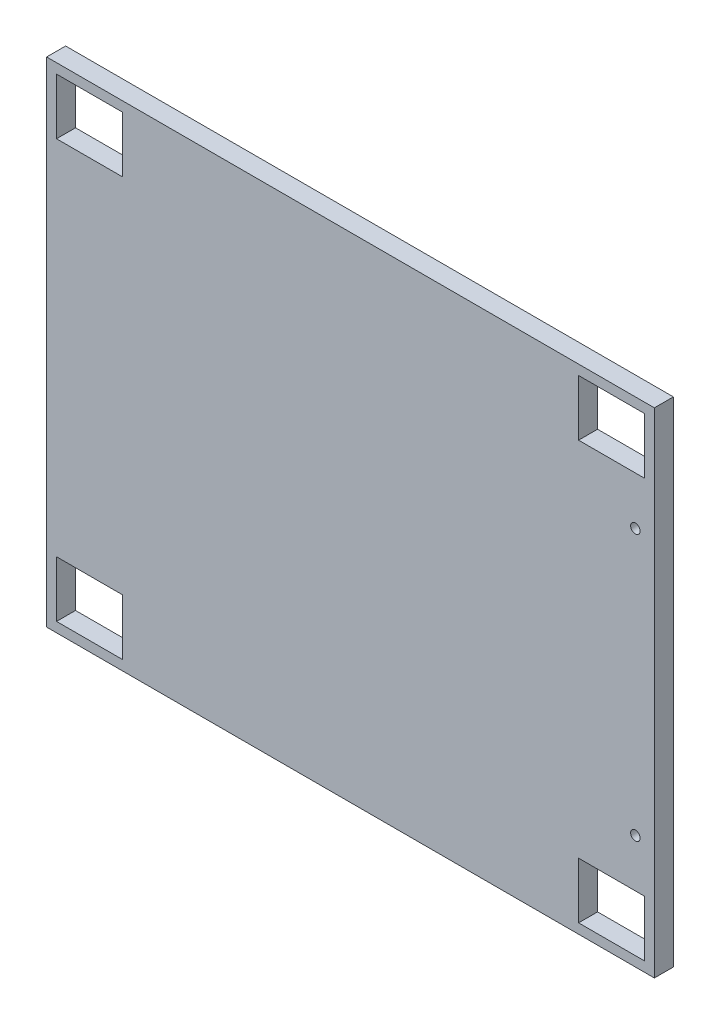
ISO-10303-21;
HEADER;
FILE_DESCRIPTION(('STEP AP214'),'2;1');
FILE_NAME('part.step','',(''),(''),'','','');
FILE_SCHEMA(('AUTOMOTIVE_DESIGN { 1 0 10303 214 1 1 1 1 }'));
ENDSEC;
DATA;
#1=APPLICATION_CONTEXT('core data for automotive mechanical design processes');
#2=APPLICATION_PROTOCOL_DEFINITION('international standard','automotive_design',2000,#1);
#3=PRODUCT_CONTEXT('',#1,'mechanical');
#4=PRODUCT('Part','Part','',(#3));
#5=PRODUCT_RELATED_PRODUCT_CATEGORY('part','',(#4));
#6=PRODUCT_DEFINITION_FORMATION('','',#4);
#7=PRODUCT_DEFINITION_CONTEXT('part definition',#1,'design');
#8=PRODUCT_DEFINITION('design','',#6,#7);
#9=PRODUCT_DEFINITION_SHAPE('','',#8);
#10=(LENGTH_UNIT() NAMED_UNIT(*) SI_UNIT(.MILLI.,.METRE.));
#11=(NAMED_UNIT(*) PLANE_ANGLE_UNIT() SI_UNIT($,.RADIAN.));
#12=(NAMED_UNIT(*) SI_UNIT($,.STERADIAN.) SOLID_ANGLE_UNIT());
#13=UNCERTAINTY_MEASURE_WITH_UNIT(LENGTH_MEASURE(1.E-05),#10,'distance_accuracy_value','');
#14=(GEOMETRIC_REPRESENTATION_CONTEXT(3) GLOBAL_UNCERTAINTY_ASSIGNED_CONTEXT((#13)) GLOBAL_UNIT_ASSIGNED_CONTEXT((#10,
#11,#12)) REPRESENTATION_CONTEXT('',''));
#15=CARTESIAN_POINT('',(0.,0.,0.));
#16=DIRECTION('',(0.,0.,1.));
#17=DIRECTION('',(1.,0.,0.));
#18=AXIS2_PLACEMENT_3D('',#15,#16,#17);
#19=CARTESIAN_POINT('',(0.,0.,6.35));
#20=DIRECTION('',(0.,0.,1.));
#21=DIRECTION('',(1.,0.,0.));
#22=AXIS2_PLACEMENT_3D('',#19,#20,#21);
#23=PLANE('',#22);
#24=CARTESIAN_POINT('',(66.0982246936658,37.2916373647231,6.35));
#25=DIRECTION('',(0.,0.,1.));
#26=DIRECTION('',(1.,0.,0.));
#27=AXIS2_PLACEMENT_3D('',#24,#25,#26);
#28=CIRCLE('',#27,1.58749999999999);
#29=CARTESIAN_POINT('',(67.6857246936658,37.2916373647231,6.35));
#30=VERTEX_POINT('',#29);
#31=EDGE_CURVE('E212',#30,#30,#28,.T.);
#32=ORIENTED_EDGE('',*,*,#31,.F.);
#33=EDGE_LOOP('',(#32));
#34=FACE_BOUND('',#33,.T.);
#35=DIRECTION('',(0.,1.,0.));
#36=VECTOR('',#35,1.);
#37=CARTESIAN_POINT('',(72.4482246936658,75.3916373647231,6.35));
#38=LINE('',#37,#36);
#39=CARTESIAN_POINT('',(72.4482246936657,-89.7083626352769,6.35));
#40=VERTEX_POINT('',#39);
#41=CARTESIAN_POINT('',(72.4482246936658,75.3916373647231,6.35));
#42=VERTEX_POINT('',#41);
#43=EDGE_CURVE('E357',#40,#42,#38,.T.);
#44=ORIENTED_EDGE('',*,*,#43,.T.);
#45=DIRECTION('',(-1.,0.,0.));
#46=VECTOR('',#45,1.);
#47=CARTESIAN_POINT('',(-130.751775306334,75.3916373647231,6.35));
#48=LINE('',#47,#46);
#49=CARTESIAN_POINT('',(-130.751775306334,75.3916373647231,6.35));
#50=VERTEX_POINT('',#49);
#51=EDGE_CURVE('E361',#42,#50,#48,.T.);
#52=ORIENTED_EDGE('',*,*,#51,.T.);
#53=DIRECTION('',(0.,-1.,0.));
#54=VECTOR('',#53,1.);
#55=CARTESIAN_POINT('',(-130.751775306334,75.3916373647231,6.35));
#56=LINE('',#55,#54);
#57=CARTESIAN_POINT('',(-130.751775306334,-89.7083626352769,6.35));
#58=VERTEX_POINT('',#57);
#59=EDGE_CURVE('E365',#50,#58,#56,.T.);
#60=ORIENTED_EDGE('',*,*,#59,.T.);
#61=DIRECTION('',(1.,0.,0.));
#62=VECTOR('',#61,1.);
#63=CARTESIAN_POINT('',(-130.751775306334,-89.7083626352769,6.35));
#64=LINE('',#63,#62);
#65=EDGE_CURVE('E368',#58,#40,#64,.T.);
#66=ORIENTED_EDGE('',*,*,#65,.T.);
#67=EDGE_LOOP('',(#44,#52,#60,#66));
#68=FACE_BOUND('',#67,.T.);
#69=DIRECTION('',(-1.,0.,0.));
#70=VECTOR('',#69,1.);
#71=CARTESIAN_POINT('',(-127.449775306334,72.0896373647231,6.35));
#72=LINE('',#71,#70);
#73=CARTESIAN_POINT('',(-105.415275306334,72.0896373647231,6.35));
#74=VERTEX_POINT('',#73);
#75=CARTESIAN_POINT('',(-127.449775306334,72.0896373647231,6.35));
#76=VERTEX_POINT('',#75);
#77=EDGE_CURVE('E317',#74,#76,#72,.T.);
#78=ORIENTED_EDGE('',*,*,#77,.F.);
#79=DIRECTION('',(0.,1.,0.));
#80=VECTOR('',#79,1.);
#81=CARTESIAN_POINT('',(-105.415275306334,72.0896373647231,6.35));
#82=LINE('',#81,#80);
#83=CARTESIAN_POINT('',(-105.415275306334,53.3571373647231,6.35));
#84=VERTEX_POINT('',#83);
#85=EDGE_CURVE('E314',#84,#74,#82,.T.);
#86=ORIENTED_EDGE('',*,*,#85,.F.);
#87=DIRECTION('',(1.,0.,0.));
#88=VECTOR('',#87,1.);
#89=CARTESIAN_POINT('',(-127.449775306334,53.3571373647231,6.35));
#90=LINE('',#89,#88);
#91=CARTESIAN_POINT('',(-127.449775306334,53.3571373647231,6.35));
#92=VERTEX_POINT('',#91);
#93=EDGE_CURVE('E325',#92,#84,#90,.T.);
#94=ORIENTED_EDGE('',*,*,#93,.F.);
#95=DIRECTION('',(0.,-1.,0.));
#96=VECTOR('',#95,1.);
#97=CARTESIAN_POINT('',(-127.449775306334,72.0896373647231,6.35));
#98=LINE('',#97,#96);
#99=EDGE_CURVE('E321',#76,#92,#98,.T.);
#100=ORIENTED_EDGE('',*,*,#99,.F.);
#101=EDGE_LOOP('',(#78,#86,#94,#100));
#102=FACE_BOUND('',#101,.T.);
#103=DIRECTION('',(0.,1.,0.));
#104=VECTOR('',#103,1.);
#105=CARTESIAN_POINT('',(69.1462246936657,72.0896373647231,6.35));
#106=LINE('',#105,#104);
#107=CARTESIAN_POINT('',(69.1462246936657,53.3571373647231,6.35));
#108=VERTEX_POINT('',#107);
#109=CARTESIAN_POINT('',(69.1462246936657,72.0896373647231,6.35));
#110=VERTEX_POINT('',#109);
#111=EDGE_CURVE('E274',#108,#110,#106,.T.);
#112=ORIENTED_EDGE('',*,*,#111,.F.);
#113=DIRECTION('',(1.,0.,0.));
#114=VECTOR('',#113,1.);
#115=CARTESIAN_POINT('',(47.1117246936657,53.3571373647231,6.35));
#116=LINE('',#115,#114);
#117=CARTESIAN_POINT('',(47.1117246936657,53.3571373647231,6.35));
#118=VERTEX_POINT('',#117);
#119=EDGE_CURVE('E271',#118,#108,#116,.T.);
#120=ORIENTED_EDGE('',*,*,#119,.F.);
#121=DIRECTION('',(0.,-1.,0.));
#122=VECTOR('',#121,1.);
#123=CARTESIAN_POINT('',(47.1117246936657,72.0896373647231,6.35));
#124=LINE('',#123,#122);
#125=CARTESIAN_POINT('',(47.1117246936657,72.0896373647231,6.35));
#126=VERTEX_POINT('',#125);
#127=EDGE_CURVE('E282',#126,#118,#124,.T.);
#128=ORIENTED_EDGE('',*,*,#127,.F.);
#129=DIRECTION('',(-1.,0.,0.));
#130=VECTOR('',#129,1.);
#131=CARTESIAN_POINT('',(47.1117246936657,72.0896373647231,6.35));
#132=LINE('',#131,#130);
#133=EDGE_CURVE('E278',#110,#126,#132,.T.);
#134=ORIENTED_EDGE('',*,*,#133,.F.);
#135=EDGE_LOOP('',(#112,#120,#128,#134));
#136=FACE_BOUND('',#135,.T.);
#137=DIRECTION('',(0.,1.,0.));
#138=VECTOR('',#137,1.);
#139=CARTESIAN_POINT('',(69.1462246936771,-67.6738626352769,6.35));
#140=LINE('',#139,#138);
#141=CARTESIAN_POINT('',(69.1462246936771,-86.4063626352769,6.35));
#142=VERTEX_POINT('',#141);
#143=CARTESIAN_POINT('',(69.1462246936771,-67.6738626352769,6.35));
#144=VERTEX_POINT('',#143);
#145=EDGE_CURVE('E231',#142,#144,#140,.T.);
#146=ORIENTED_EDGE('',*,*,#145,.F.);
#147=DIRECTION('',(1.,0.,0.));
#148=VECTOR('',#147,1.);
#149=CARTESIAN_POINT('',(47.1117246936771,-86.4063626352769,6.35));
#150=LINE('',#149,#148);
#151=CARTESIAN_POINT('',(47.1117246936771,-86.4063626352769,6.35));
#152=VERTEX_POINT('',#151);
#153=EDGE_CURVE('E228',#152,#142,#150,.T.);
#154=ORIENTED_EDGE('',*,*,#153,.F.);
#155=DIRECTION('',(0.,-1.,0.));
#156=VECTOR('',#155,1.);
#157=CARTESIAN_POINT('',(47.1117246936771,-67.6738626352769,6.35));
#158=LINE('',#157,#156);
#159=CARTESIAN_POINT('',(47.1117246936771,-67.6738626352769,6.35));
#160=VERTEX_POINT('',#159);
#161=EDGE_CURVE('E239',#160,#152,#158,.T.);
#162=ORIENTED_EDGE('',*,*,#161,.F.);
#163=DIRECTION('',(-1.,0.,0.));
#164=VECTOR('',#163,1.);
#165=CARTESIAN_POINT('',(47.1117246936771,-67.6738626352769,6.35));
#166=LINE('',#165,#164);
#167=EDGE_CURVE('E235',#144,#160,#166,.T.);
#168=ORIENTED_EDGE('',*,*,#167,.F.);
#169=EDGE_LOOP('',(#146,#154,#162,#168));
#170=FACE_BOUND('',#169,.T.);
#171=DIRECTION('',(0.,1.,0.));
#172=VECTOR('',#171,1.);
#173=CARTESIAN_POINT('',(-105.415275306323,-67.6738626352769,6.35));
#174=LINE('',#173,#172);
#175=CARTESIAN_POINT('',(-105.415275306323,-86.4063626352769,6.35));
#176=VERTEX_POINT('',#175);
#177=CARTESIAN_POINT('',(-105.415275306323,-67.6738626352769,6.35));
#178=VERTEX_POINT('',#177);
#179=EDGE_CURVE('E186',#176,#178,#174,.T.);
#180=ORIENTED_EDGE('',*,*,#179,.F.);
#181=DIRECTION('',(1.,0.,0.));
#182=VECTOR('',#181,1.);
#183=CARTESIAN_POINT('',(-127.449775306323,-86.4063626352769,6.35));
#184=LINE('',#183,#182);
#185=CARTESIAN_POINT('',(-127.449775306323,-86.4063626352769,6.35));
#186=VERTEX_POINT('',#185);
#187=EDGE_CURVE('E177',#186,#176,#184,.T.);
#188=ORIENTED_EDGE('',*,*,#187,.F.);
#189=DIRECTION('',(0.,-1.,0.));
#190=VECTOR('',#189,1.);
#191=CARTESIAN_POINT('',(-127.449775306323,-67.6738626352769,6.35));
#192=LINE('',#191,#190);
#193=CARTESIAN_POINT('',(-127.449775306323,-67.6738626352769,6.35));
#194=VERTEX_POINT('',#193);
#195=EDGE_CURVE('E204',#194,#186,#192,.T.);
#196=ORIENTED_EDGE('',*,*,#195,.F.);
#197=DIRECTION('',(-1.,0.,0.));
#198=VECTOR('',#197,1.);
#199=CARTESIAN_POINT('',(-127.449775306323,-67.6738626352769,6.35));
#200=LINE('',#199,#198);
#201=EDGE_CURVE('E200',#178,#194,#200,.T.);
#202=ORIENTED_EDGE('',*,*,#201,.F.);
#203=EDGE_LOOP('',(#180,#188,#196,#202));
#204=FACE_BOUND('',#203,.T.);
#205=CARTESIAN_POINT('',(66.0982246936693,-51.6083626352769,6.35));
#206=DIRECTION('',(0.,0.,1.));
#207=DIRECTION('',(1.,0.,0.));
#208=AXIS2_PLACEMENT_3D('',#205,#206,#207);
#209=CIRCLE('',#208,1.5875);
#210=CARTESIAN_POINT('',(67.6857246936693,-51.6083626352769,6.35));
#211=VERTEX_POINT('',#210);
#212=EDGE_CURVE('E610',#211,#211,#209,.T.);
#213=ORIENTED_EDGE('',*,*,#212,.F.);
#214=EDGE_LOOP('',(#213));
#215=FACE_BOUND('',#214,.T.);
#216=ADVANCED_FACE('F39',(#34,#68,#102,#136,#170,#204,#215),#23,.T.);
#217=CARTESIAN_POINT('',(0.,0.,0.));
#218=DIRECTION('',(0.,0.,1.));
#219=DIRECTION('',(1.,0.,0.));
#220=AXIS2_PLACEMENT_3D('',#217,#218,#219);
#221=PLANE('',#220);
#222=DIRECTION('',(1.,0.,0.));
#223=VECTOR('',#222,1.);
#224=CARTESIAN_POINT('',(47.1117246936771,-86.4063626352769,0.));
#225=LINE('',#224,#223);
#226=CARTESIAN_POINT('',(47.1117246936771,-86.4063626352769,0.));
#227=VERTEX_POINT('',#226);
#228=CARTESIAN_POINT('',(69.1462246936771,-86.4063626352769,0.));
#229=VERTEX_POINT('',#228);
#230=EDGE_CURVE('E195',#227,#229,#225,.T.);
#231=ORIENTED_EDGE('',*,*,#230,.T.);
#232=DIRECTION('',(0.,1.,0.));
#233=VECTOR('',#232,1.);
#234=CARTESIAN_POINT('',(69.1462246936771,-67.6738626352769,0.));
#235=LINE('',#234,#233);
#236=CARTESIAN_POINT('',(69.1462246936771,-67.6738626352769,0.));
#237=VERTEX_POINT('',#236);
#238=EDGE_CURVE('E246',#229,#237,#235,.T.);
#239=ORIENTED_EDGE('',*,*,#238,.T.);
#240=DIRECTION('',(-1.,0.,0.));
#241=VECTOR('',#240,1.);
#242=CARTESIAN_POINT('',(47.1117246936771,-67.6738626352769,0.));
#243=LINE('',#242,#241);
#244=CARTESIAN_POINT('',(47.1117246936771,-67.6738626352769,0.));
#245=VERTEX_POINT('',#244);
#246=EDGE_CURVE('E250',#237,#245,#243,.T.);
#247=ORIENTED_EDGE('',*,*,#246,.T.);
#248=DIRECTION('',(0.,-1.,0.));
#249=VECTOR('',#248,1.);
#250=CARTESIAN_POINT('',(47.1117246936771,-67.6738626352769,0.));
#251=LINE('',#250,#249);
#252=EDGE_CURVE('E232',#245,#227,#251,.T.);
#253=ORIENTED_EDGE('',*,*,#252,.T.);
#254=EDGE_LOOP('',(#231,#239,#247,#253));
#255=FACE_BOUND('',#254,.T.);
#256=DIRECTION('',(0.,1.,0.));
#257=VECTOR('',#256,1.);
#258=CARTESIAN_POINT('',(-105.415275306334,72.0896373647231,0.));
#259=LINE('',#258,#257);
#260=CARTESIAN_POINT('',(-105.415275306334,53.3571373647231,0.));
#261=VERTEX_POINT('',#260);
#262=CARTESIAN_POINT('',(-105.415275306334,72.0896373647231,0.));
#263=VERTEX_POINT('',#262);
#264=EDGE_CURVE('E313',#261,#263,#259,.T.);
#265=ORIENTED_EDGE('',*,*,#264,.T.);
#266=DIRECTION('',(-1.,0.,0.));
#267=VECTOR('',#266,1.);
#268=CARTESIAN_POINT('',(-127.449775306334,72.0896373647231,0.));
#269=LINE('',#268,#267);
#270=CARTESIAN_POINT('',(-127.449775306334,72.0896373647231,0.));
#271=VERTEX_POINT('',#270);
#272=EDGE_CURVE('E332',#263,#271,#269,.T.);
#273=ORIENTED_EDGE('',*,*,#272,.T.);
#274=DIRECTION('',(0.,-1.,0.));
#275=VECTOR('',#274,1.);
#276=CARTESIAN_POINT('',(-127.449775306334,72.0896373647231,0.));
#277=LINE('',#276,#275);
#278=CARTESIAN_POINT('',(-127.449775306334,53.3571373647231,0.));
#279=VERTEX_POINT('',#278);
#280=EDGE_CURVE('E336',#271,#279,#277,.T.);
#281=ORIENTED_EDGE('',*,*,#280,.T.);
#282=DIRECTION('',(1.,0.,0.));
#283=VECTOR('',#282,1.);
#284=CARTESIAN_POINT('',(-127.449775306334,53.3571373647231,0.));
#285=LINE('',#284,#283);
#286=EDGE_CURVE('E318',#279,#261,#285,.T.);
#287=ORIENTED_EDGE('',*,*,#286,.T.);
#288=EDGE_LOOP('',(#265,#273,#281,#287));
#289=FACE_BOUND('',#288,.T.);
#290=DIRECTION('',(0.,1.,0.));
#291=VECTOR('',#290,1.);
#292=CARTESIAN_POINT('',(72.4482246936658,75.3916373647231,0.));
#293=LINE('',#292,#291);
#294=CARTESIAN_POINT('',(72.4482246936657,-89.7083626352769,0.));
#295=VERTEX_POINT('',#294);
#296=CARTESIAN_POINT('',(72.4482246936658,75.3916373647231,0.));
#297=VERTEX_POINT('',#296);
#298=EDGE_CURVE('E356',#295,#297,#293,.T.);
#299=ORIENTED_EDGE('',*,*,#298,.F.);
#300=DIRECTION('',(1.,0.,0.));
#301=VECTOR('',#300,1.);
#302=CARTESIAN_POINT('',(-130.751775306334,-89.7083626352769,0.));
#303=LINE('',#302,#301);
#304=CARTESIAN_POINT('',(-130.751775306334,-89.7083626352769,0.));
#305=VERTEX_POINT('',#304);
#306=EDGE_CURVE('E362',#305,#295,#303,.T.);
#307=ORIENTED_EDGE('',*,*,#306,.F.);
#308=DIRECTION('',(0.,-1.,0.));
#309=VECTOR('',#308,1.);
#310=CARTESIAN_POINT('',(-130.751775306334,75.3916373647231,0.));
#311=LINE('',#310,#309);
#312=CARTESIAN_POINT('',(-130.751775306334,75.3916373647231,0.));
#313=VERTEX_POINT('',#312);
#314=EDGE_CURVE('E378',#313,#305,#311,.T.);
#315=ORIENTED_EDGE('',*,*,#314,.F.);
#316=DIRECTION('',(-1.,0.,0.));
#317=VECTOR('',#316,1.);
#318=CARTESIAN_POINT('',(-130.751775306334,75.3916373647231,0.));
#319=LINE('',#318,#317);
#320=EDGE_CURVE('E375',#297,#313,#319,.T.);
#321=ORIENTED_EDGE('',*,*,#320,.F.);
#322=EDGE_LOOP('',(#299,#307,#315,#321));
#323=FACE_BOUND('',#322,.T.);
#324=DIRECTION('',(1.,0.,0.));
#325=VECTOR('',#324,1.);
#326=CARTESIAN_POINT('',(47.1117246936657,53.3571373647231,0.));
#327=LINE('',#326,#325);
#328=CARTESIAN_POINT('',(47.1117246936657,53.3571373647231,0.));
#329=VERTEX_POINT('',#328);
#330=CARTESIAN_POINT('',(69.1462246936657,53.3571373647231,0.));
#331=VERTEX_POINT('',#330);
#332=EDGE_CURVE('E270',#329,#331,#327,.T.);
#333=ORIENTED_EDGE('',*,*,#332,.T.);
#334=DIRECTION('',(0.,1.,0.));
#335=VECTOR('',#334,1.);
#336=CARTESIAN_POINT('',(69.1462246936657,72.0896373647231,0.));
#337=LINE('',#336,#335);
#338=CARTESIAN_POINT('',(69.1462246936657,72.0896373647231,0.));
#339=VERTEX_POINT('',#338);
#340=EDGE_CURVE('E289',#331,#339,#337,.T.);
#341=ORIENTED_EDGE('',*,*,#340,.T.);
#342=DIRECTION('',(-1.,0.,0.));
#343=VECTOR('',#342,1.);
#344=CARTESIAN_POINT('',(47.1117246936657,72.0896373647231,0.));
#345=LINE('',#344,#343);
#346=CARTESIAN_POINT('',(47.1117246936657,72.0896373647231,0.));
#347=VERTEX_POINT('',#346);
#348=EDGE_CURVE('E293',#339,#347,#345,.T.);
#349=ORIENTED_EDGE('',*,*,#348,.T.);
#350=DIRECTION('',(0.,-1.,0.));
#351=VECTOR('',#350,1.);
#352=CARTESIAN_POINT('',(47.1117246936657,72.0896373647231,0.));
#353=LINE('',#352,#351);
#354=EDGE_CURVE('E275',#347,#329,#353,.T.);
#355=ORIENTED_EDGE('',*,*,#354,.T.);
#356=EDGE_LOOP('',(#333,#341,#349,#355));
#357=FACE_BOUND('',#356,.T.);
#358=DIRECTION('',(1.,0.,0.));
#359=VECTOR('',#358,1.);
#360=CARTESIAN_POINT('',(-127.449775306323,-86.4063626352769,0.));
#361=LINE('',#360,#359);
#362=CARTESIAN_POINT('',(-127.449775306323,-86.4063626352769,0.));
#363=VERTEX_POINT('',#362);
#364=CARTESIAN_POINT('',(-105.415275306323,-86.4063626352769,0.));
#365=VERTEX_POINT('',#364);
#366=EDGE_CURVE('E63',#363,#365,#361,.T.);
#367=ORIENTED_EDGE('',*,*,#366,.T.);
#368=DIRECTION('',(0.,1.,0.));
#369=VECTOR('',#368,1.);
#370=CARTESIAN_POINT('',(-105.415275306323,-67.6738626352769,0.));
#371=LINE('',#370,#369);
#372=CARTESIAN_POINT('',(-105.415275306323,-67.6738626352769,0.));
#373=VERTEX_POINT('',#372);
#374=EDGE_CURVE('E193',#365,#373,#371,.T.);
#375=ORIENTED_EDGE('',*,*,#374,.T.);
#376=DIRECTION('',(-1.,0.,0.));
#377=VECTOR('',#376,1.);
#378=CARTESIAN_POINT('',(-127.449775306323,-67.6738626352769,0.));
#379=LINE('',#378,#377);
#380=CARTESIAN_POINT('',(-127.449775306323,-67.6738626352769,0.));
#381=VERTEX_POINT('',#380);
#382=EDGE_CURVE('E215',#373,#381,#379,.T.);
#383=ORIENTED_EDGE('',*,*,#382,.T.);
#384=DIRECTION('',(0.,-1.,0.));
#385=VECTOR('',#384,1.);
#386=CARTESIAN_POINT('',(-127.449775306323,-67.6738626352769,0.));
#387=LINE('',#386,#385);
#388=EDGE_CURVE('E187',#381,#363,#387,.T.);
#389=ORIENTED_EDGE('',*,*,#388,.T.);
#390=EDGE_LOOP('',(#367,#375,#383,#389));
#391=FACE_BOUND('',#390,.T.);
#392=CARTESIAN_POINT('',(66.0982246936658,37.2916373647231,0.));
#393=DIRECTION('',(0.,0.,1.));
#394=DIRECTION('',(1.,0.,0.));
#395=AXIS2_PLACEMENT_3D('',#392,#393,#394);
#396=CIRCLE('',#395,1.58749999999999);
#397=CARTESIAN_POINT('',(67.6857246936658,37.2916373647231,0.));
#398=VERTEX_POINT('',#397);
#399=EDGE_CURVE('E618',#398,#398,#396,.T.);
#400=ORIENTED_EDGE('',*,*,#399,.T.);
#401=EDGE_LOOP('',(#400));
#402=FACE_BOUND('',#401,.T.);
#403=CARTESIAN_POINT('',(66.0982246936693,-51.6083626352769,0.));
#404=DIRECTION('',(0.,0.,1.));
#405=DIRECTION('',(1.,0.,0.));
#406=AXIS2_PLACEMENT_3D('',#403,#404,#405);
#407=CIRCLE('',#406,1.5875);
#408=CARTESIAN_POINT('',(67.6857246936693,-51.6083626352769,0.));
#409=VERTEX_POINT('',#408);
#410=EDGE_CURVE('E613',#409,#409,#407,.T.);
#411=ORIENTED_EDGE('',*,*,#410,.T.);
#412=EDGE_LOOP('',(#411));
#413=FACE_BOUND('',#412,.T.);
#414=ADVANCED_FACE('F401',(#255,#289,#323,#357,#391,#402,#413),#221,.F.);
#415=CARTESIAN_POINT('',(72.4482246936658,75.3916373647231,6.35));
#416=DIRECTION('',(-1.,0.,0.));
#417=DIRECTION('',(0.,-1.,0.));
#418=AXIS2_PLACEMENT_3D('',#415,#416,#417);
#419=PLANE('',#418);
#420=ORIENTED_EDGE('',*,*,#298,.T.);
#421=DIRECTION('',(0.,0.,-1.));
#422=VECTOR('',#421,1.);
#423=CARTESIAN_POINT('',(72.4482246936658,75.3916373647231,6.35));
#424=LINE('',#423,#422);
#425=EDGE_CURVE('E11',#42,#297,#424,.T.);
#426=ORIENTED_EDGE('',*,*,#425,.F.);
#427=ORIENTED_EDGE('',*,*,#43,.F.);
#428=DIRECTION('',(0.,0.,-1.));
#429=VECTOR('',#428,1.);
#430=CARTESIAN_POINT('',(72.4482246936657,-89.7083626352769,6.35));
#431=LINE('',#430,#429);
#432=EDGE_CURVE('E371',#40,#295,#431,.T.);
#433=ORIENTED_EDGE('',*,*,#432,.T.);
#434=EDGE_LOOP('',(#420,#426,#427,#433));
#435=FACE_BOUND('',#434,.T.);
#436=ADVANCED_FACE('F41',(#435),#419,.F.);
#437=CARTESIAN_POINT('',(-130.751775306334,75.3916373647231,6.35));
#438=DIRECTION('',(0.,-1.,0.));
#439=DIRECTION('',(0.,0.,-1.));
#440=AXIS2_PLACEMENT_3D('',#437,#438,#439);
#441=PLANE('',#440);
#442=ORIENTED_EDGE('',*,*,#320,.T.);
#443=DIRECTION('',(0.,0.,-1.));
#444=VECTOR('',#443,1.);
#445=CARTESIAN_POINT('',(-130.751775306334,75.3916373647231,6.35));
#446=LINE('',#445,#444);
#447=EDGE_CURVE('E48',#50,#313,#446,.T.);
#448=ORIENTED_EDGE('',*,*,#447,.F.);
#449=ORIENTED_EDGE('',*,*,#51,.F.);
#450=ORIENTED_EDGE('',*,*,#425,.T.);
#451=EDGE_LOOP('',(#442,#448,#449,#450));
#452=FACE_BOUND('',#451,.T.);
#453=ADVANCED_FACE('F412',(#452),#441,.F.);
#454=CARTESIAN_POINT('',(-130.751775306334,75.3916373647231,6.35));
#455=DIRECTION('',(1.,0.,0.));
#456=DIRECTION('',(0.,1.,0.));
#457=AXIS2_PLACEMENT_3D('',#454,#455,#456);
#458=PLANE('',#457);
#459=ORIENTED_EDGE('',*,*,#314,.T.);
#460=DIRECTION('',(0.,0.,-1.));
#461=VECTOR('',#460,1.);
#462=CARTESIAN_POINT('',(-130.751775306334,-89.7083626352769,6.35));
#463=LINE('',#462,#461);
#464=EDGE_CURVE('E386',#58,#305,#463,.T.);
#465=ORIENTED_EDGE('',*,*,#464,.F.);
#466=ORIENTED_EDGE('',*,*,#59,.F.);
#467=ORIENTED_EDGE('',*,*,#447,.T.);
#468=EDGE_LOOP('',(#459,#465,#466,#467));
#469=FACE_BOUND('',#468,.T.);
#470=ADVANCED_FACE('F395',(#469),#458,.F.);
#471=CARTESIAN_POINT('',(-130.751775306334,-89.7083626352769,6.35));
#472=DIRECTION('',(0.,1.,0.));
#473=DIRECTION('',(0.,0.,1.));
#474=AXIS2_PLACEMENT_3D('',#471,#472,#473);
#475=PLANE('',#474);
#476=ORIENTED_EDGE('',*,*,#306,.T.);
#477=ORIENTED_EDGE('',*,*,#432,.F.);
#478=ORIENTED_EDGE('',*,*,#65,.F.);
#479=ORIENTED_EDGE('',*,*,#464,.T.);
#480=EDGE_LOOP('',(#476,#477,#478,#479));
#481=FACE_BOUND('',#480,.T.);
#482=ADVANCED_FACE('F405',(#481),#475,.F.);
#483=CARTESIAN_POINT('',(-105.415275306334,72.0896373647231,6.35));
#484=DIRECTION('',(-1.,0.,0.));
#485=DIRECTION('',(0.,-1.,0.));
#486=AXIS2_PLACEMENT_3D('',#483,#484,#485);
#487=PLANE('',#486);
#488=ORIENTED_EDGE('',*,*,#264,.F.);
#489=DIRECTION('',(0.,0.,-1.));
#490=VECTOR('',#489,1.);
#491=CARTESIAN_POINT('',(-105.415275306334,53.3571373647231,6.35));
#492=LINE('',#491,#490);
#493=EDGE_CURVE('E328',#84,#261,#492,.T.);
#494=ORIENTED_EDGE('',*,*,#493,.F.);
#495=ORIENTED_EDGE('',*,*,#85,.T.);
#496=DIRECTION('',(0.,0.,-1.));
#497=VECTOR('',#496,1.);
#498=CARTESIAN_POINT('',(-105.415275306334,72.0896373647231,6.35));
#499=LINE('',#498,#497);
#500=EDGE_CURVE('E352',#74,#263,#499,.T.);
#501=ORIENTED_EDGE('',*,*,#500,.T.);
#502=EDGE_LOOP('',(#488,#494,#495,#501));
#503=FACE_BOUND('',#502,.T.);
#504=ADVANCED_FACE('F429',(#503),#487,.T.);
#505=CARTESIAN_POINT('',(-127.449775306334,72.0896373647231,6.35));
#506=DIRECTION('',(0.,-1.,0.));
#507=DIRECTION('',(1.,0.,0.));
#508=AXIS2_PLACEMENT_3D('',#505,#506,#507);
#509=PLANE('',#508);
#510=ORIENTED_EDGE('',*,*,#272,.F.);
#511=ORIENTED_EDGE('',*,*,#500,.F.);
#512=ORIENTED_EDGE('',*,*,#77,.T.);
#513=DIRECTION('',(0.,0.,-1.));
#514=VECTOR('',#513,1.);
#515=CARTESIAN_POINT('',(-127.449775306334,72.0896373647231,6.35));
#516=LINE('',#515,#514);
#517=EDGE_CURVE('E349',#76,#271,#516,.T.);
#518=ORIENTED_EDGE('',*,*,#517,.T.);
#519=EDGE_LOOP('',(#510,#511,#512,#518));
#520=FACE_BOUND('',#519,.T.);
#521=ADVANCED_FACE('F436',(#520),#509,.T.);
#522=CARTESIAN_POINT('',(-127.449775306334,72.0896373647231,6.35));
#523=DIRECTION('',(1.,0.,0.));
#524=DIRECTION('',(0.,1.,0.));
#525=AXIS2_PLACEMENT_3D('',#522,#523,#524);
#526=PLANE('',#525);
#527=ORIENTED_EDGE('',*,*,#280,.F.);
#528=ORIENTED_EDGE('',*,*,#517,.F.);
#529=ORIENTED_EDGE('',*,*,#99,.T.);
#530=DIRECTION('',(0.,0.,-1.));
#531=VECTOR('',#530,1.);
#532=CARTESIAN_POINT('',(-127.449775306334,53.3571373647231,6.35));
#533=LINE('',#532,#531);
#534=EDGE_CURVE('E346',#92,#279,#533,.T.);
#535=ORIENTED_EDGE('',*,*,#534,.T.);
#536=EDGE_LOOP('',(#527,#528,#529,#535));
#537=FACE_BOUND('',#536,.T.);
#538=ADVANCED_FACE('F441',(#537),#526,.T.);
#539=CARTESIAN_POINT('',(-127.449775306334,53.3571373647231,6.35));
#540=DIRECTION('',(0.,1.,0.));
#541=DIRECTION('',(-1.,0.,0.));
#542=AXIS2_PLACEMENT_3D('',#539,#540,#541);
#543=PLANE('',#542);
#544=ORIENTED_EDGE('',*,*,#286,.F.);
#545=ORIENTED_EDGE('',*,*,#534,.F.);
#546=ORIENTED_EDGE('',*,*,#93,.T.);
#547=ORIENTED_EDGE('',*,*,#493,.T.);
#548=EDGE_LOOP('',(#544,#545,#546,#547));
#549=FACE_BOUND('',#548,.T.);
#550=ADVANCED_FACE('F449',(#549),#543,.T.);
#551=CARTESIAN_POINT('',(47.1117246936657,53.3571373647231,6.35));
#552=DIRECTION('',(0.,1.,0.));
#553=DIRECTION('',(0.,0.,1.));
#554=AXIS2_PLACEMENT_3D('',#551,#552,#553);
#555=PLANE('',#554);
#556=ORIENTED_EDGE('',*,*,#332,.F.);
#557=DIRECTION('',(0.,0.,-1.));
#558=VECTOR('',#557,1.);
#559=CARTESIAN_POINT('',(47.1117246936657,53.3571373647231,6.35));
#560=LINE('',#559,#558);
#561=EDGE_CURVE('E285',#118,#329,#560,.T.);
#562=ORIENTED_EDGE('',*,*,#561,.F.);
#563=ORIENTED_EDGE('',*,*,#119,.T.);
#564=DIRECTION('',(0.,0.,-1.));
#565=VECTOR('',#564,1.);
#566=CARTESIAN_POINT('',(69.1462246936657,53.3571373647231,6.35));
#567=LINE('',#566,#565);
#568=EDGE_CURVE('E309',#108,#331,#567,.T.);
#569=ORIENTED_EDGE('',*,*,#568,.T.);
#570=EDGE_LOOP('',(#556,#562,#563,#569));
#571=FACE_BOUND('',#570,.T.);
#572=ADVANCED_FACE('F503',(#571),#555,.T.);
#573=CARTESIAN_POINT('',(69.1462246936657,72.0896373647231,6.35));
#574=DIRECTION('',(-1.,0.,0.));
#575=DIRECTION('',(0.,-1.,0.));
#576=AXIS2_PLACEMENT_3D('',#573,#574,#575);
#577=PLANE('',#576);
#578=ORIENTED_EDGE('',*,*,#340,.F.);
#579=ORIENTED_EDGE('',*,*,#568,.F.);
#580=ORIENTED_EDGE('',*,*,#111,.T.);
#581=DIRECTION('',(0.,0.,-1.));
#582=VECTOR('',#581,1.);
#583=CARTESIAN_POINT('',(69.1462246936657,72.0896373647231,6.35));
#584=LINE('',#583,#582);
#585=EDGE_CURVE('E306',#110,#339,#584,.T.);
#586=ORIENTED_EDGE('',*,*,#585,.T.);
#587=EDGE_LOOP('',(#578,#579,#580,#586));
#588=FACE_BOUND('',#587,.T.);
#589=ADVANCED_FACE('F499',(#588),#577,.T.);
#590=CARTESIAN_POINT('',(47.1117246936657,72.0896373647231,6.35));
#591=DIRECTION('',(0.,-1.,0.));
#592=DIRECTION('',(0.,0.,-1.));
#593=AXIS2_PLACEMENT_3D('',#590,#591,#592);
#594=PLANE('',#593);
#595=ORIENTED_EDGE('',*,*,#348,.F.);
#596=ORIENTED_EDGE('',*,*,#585,.F.);
#597=ORIENTED_EDGE('',*,*,#133,.T.);
#598=DIRECTION('',(0.,0.,-1.));
#599=VECTOR('',#598,1.);
#600=CARTESIAN_POINT('',(47.1117246936657,72.0896373647231,6.35));
#601=LINE('',#600,#599);
#602=EDGE_CURVE('E303',#126,#347,#601,.T.);
#603=ORIENTED_EDGE('',*,*,#602,.T.);
#604=EDGE_LOOP('',(#595,#596,#597,#603));
#605=FACE_BOUND('',#604,.T.);
#606=ADVANCED_FACE('F495',(#605),#594,.T.);
#607=CARTESIAN_POINT('',(47.1117246936657,72.0896373647231,6.35));
#608=DIRECTION('',(1.,0.,0.));
#609=DIRECTION('',(0.,0.,-1.));
#610=AXIS2_PLACEMENT_3D('',#607,#608,#609);
#611=PLANE('',#610);
#612=ORIENTED_EDGE('',*,*,#354,.F.);
#613=ORIENTED_EDGE('',*,*,#602,.F.);
#614=ORIENTED_EDGE('',*,*,#127,.T.);
#615=ORIENTED_EDGE('',*,*,#561,.T.);
#616=EDGE_LOOP('',(#612,#613,#614,#615));
#617=FACE_BOUND('',#616,.T.);
#618=ADVANCED_FACE('F492',(#617),#611,.T.);
#619=CARTESIAN_POINT('',(47.1117246936771,-86.4063626352769,6.35));
#620=DIRECTION('',(0.,1.,0.));
#621=DIRECTION('',(-1.,0.,0.));
#622=AXIS2_PLACEMENT_3D('',#619,#620,#621);
#623=PLANE('',#622);
#624=ORIENTED_EDGE('',*,*,#230,.F.);
#625=DIRECTION('',(0.,0.,-1.));
#626=VECTOR('',#625,1.);
#627=CARTESIAN_POINT('',(47.1117246936771,-86.4063626352769,6.35));
#628=LINE('',#627,#626);
#629=EDGE_CURVE('E242',#152,#227,#628,.T.);
#630=ORIENTED_EDGE('',*,*,#629,.F.);
#631=ORIENTED_EDGE('',*,*,#153,.T.);
#632=DIRECTION('',(0.,0.,-1.));
#633=VECTOR('',#632,1.);
#634=CARTESIAN_POINT('',(69.1462246936771,-86.4063626352769,6.35));
#635=LINE('',#634,#633);
#636=EDGE_CURVE('E266',#142,#229,#635,.T.);
#637=ORIENTED_EDGE('',*,*,#636,.T.);
#638=EDGE_LOOP('',(#624,#630,#631,#637));
#639=FACE_BOUND('',#638,.T.);
#640=ADVANCED_FACE('F474',(#639),#623,.T.);
#641=CARTESIAN_POINT('',(69.1462246936771,-67.6738626352769,6.35));
#642=DIRECTION('',(-1.,0.,0.));
#643=DIRECTION('',(0.,-1.,0.));
#644=AXIS2_PLACEMENT_3D('',#641,#642,#643);
#645=PLANE('',#644);
#646=ORIENTED_EDGE('',*,*,#238,.F.);
#647=ORIENTED_EDGE('',*,*,#636,.F.);
#648=ORIENTED_EDGE('',*,*,#145,.T.);
#649=DIRECTION('',(0.,0.,-1.));
#650=VECTOR('',#649,1.);
#651=CARTESIAN_POINT('',(69.1462246936771,-67.6738626352769,6.35));
#652=LINE('',#651,#650);
#653=EDGE_CURVE('E263',#144,#237,#652,.T.);
#654=ORIENTED_EDGE('',*,*,#653,.T.);
#655=EDGE_LOOP('',(#646,#647,#648,#654));
#656=FACE_BOUND('',#655,.T.);
#657=ADVANCED_FACE('F468',(#656),#645,.T.);
#658=CARTESIAN_POINT('',(47.1117246936771,-67.6738626352769,6.35));
#659=DIRECTION('',(0.,-1.,0.));
#660=DIRECTION('',(1.,0.,0.));
#661=AXIS2_PLACEMENT_3D('',#658,#659,#660);
#662=PLANE('',#661);
#663=ORIENTED_EDGE('',*,*,#246,.F.);
#664=ORIENTED_EDGE('',*,*,#653,.F.);
#665=ORIENTED_EDGE('',*,*,#167,.T.);
#666=DIRECTION('',(0.,0.,-1.));
#667=VECTOR('',#666,1.);
#668=CARTESIAN_POINT('',(47.1117246936771,-67.6738626352769,6.35));
#669=LINE('',#668,#667);
#670=EDGE_CURVE('E260',#160,#245,#669,.T.);
#671=ORIENTED_EDGE('',*,*,#670,.T.);
#672=EDGE_LOOP('',(#663,#664,#665,#671));
#673=FACE_BOUND('',#672,.T.);
#674=ADVANCED_FACE('F471',(#673),#662,.T.);
#675=CARTESIAN_POINT('',(47.1117246936771,-67.6738626352769,6.35));
#676=DIRECTION('',(1.,0.,0.));
#677=DIRECTION('',(0.,1.,0.));
#678=AXIS2_PLACEMENT_3D('',#675,#676,#677);
#679=PLANE('',#678);
#680=ORIENTED_EDGE('',*,*,#252,.F.);
#681=ORIENTED_EDGE('',*,*,#670,.F.);
#682=ORIENTED_EDGE('',*,*,#161,.T.);
#683=ORIENTED_EDGE('',*,*,#629,.T.);
#684=EDGE_LOOP('',(#680,#681,#682,#683));
#685=FACE_BOUND('',#684,.T.);
#686=ADVANCED_FACE('F477',(#685),#679,.T.);
#687=CARTESIAN_POINT('',(-127.449775306323,-86.4063626352769,6.35));
#688=DIRECTION('',(0.,1.,0.));
#689=DIRECTION('',(-1.,0.,0.));
#690=AXIS2_PLACEMENT_3D('',#687,#688,#689);
#691=PLANE('',#690);
#692=ORIENTED_EDGE('',*,*,#366,.F.);
#693=DIRECTION('',(0.,0.,-1.));
#694=VECTOR('',#693,1.);
#695=CARTESIAN_POINT('',(-127.449775306323,-86.4063626352769,6.35));
#696=LINE('',#695,#694);
#697=EDGE_CURVE('E181',#186,#363,#696,.T.);
#698=ORIENTED_EDGE('',*,*,#697,.F.);
#699=ORIENTED_EDGE('',*,*,#187,.T.);
#700=DIRECTION('',(0.,0.,-1.));
#701=VECTOR('',#700,1.);
#702=CARTESIAN_POINT('',(-105.415275306323,-86.4063626352769,6.35));
#703=LINE('',#702,#701);
#704=EDGE_CURVE('E180',#176,#365,#703,.T.);
#705=ORIENTED_EDGE('',*,*,#704,.T.);
#706=EDGE_LOOP('',(#692,#698,#699,#705));
#707=FACE_BOUND('',#706,.T.);
#708=ADVANCED_FACE('F179',(#707),#691,.T.);
#709=CARTESIAN_POINT('',(-105.415275306323,-67.6738626352769,6.35));
#710=DIRECTION('',(-1.,0.,0.));
#711=DIRECTION('',(0.,-1.,0.));
#712=AXIS2_PLACEMENT_3D('',#709,#710,#711);
#713=PLANE('',#712);
#714=ORIENTED_EDGE('',*,*,#374,.F.);
#715=ORIENTED_EDGE('',*,*,#704,.F.);
#716=ORIENTED_EDGE('',*,*,#179,.T.);
#717=DIRECTION('',(0.,0.,-1.));
#718=VECTOR('',#717,1.);
#719=CARTESIAN_POINT('',(-105.415275306323,-67.6738626352769,6.35));
#720=LINE('',#719,#718);
#721=EDGE_CURVE('E196',#178,#373,#720,.T.);
#722=ORIENTED_EDGE('',*,*,#721,.T.);
#723=EDGE_LOOP('',(#714,#715,#716,#722));
#724=FACE_BOUND('',#723,.T.);
#725=ADVANCED_FACE('F190',(#724),#713,.T.);
#726=CARTESIAN_POINT('',(-127.449775306323,-67.6738626352769,6.35));
#727=DIRECTION('',(0.,-1.,0.));
#728=DIRECTION('',(1.,0.,0.));
#729=AXIS2_PLACEMENT_3D('',#726,#727,#728);
#730=PLANE('',#729);
#731=ORIENTED_EDGE('',*,*,#382,.F.);
#732=ORIENTED_EDGE('',*,*,#721,.F.);
#733=ORIENTED_EDGE('',*,*,#201,.T.);
#734=DIRECTION('',(0.,0.,-1.));
#735=VECTOR('',#734,1.);
#736=CARTESIAN_POINT('',(-127.449775306323,-67.6738626352769,6.35));
#737=LINE('',#736,#735);
#738=EDGE_CURVE('E55',#194,#381,#737,.T.);
#739=ORIENTED_EDGE('',*,*,#738,.T.);
#740=EDGE_LOOP('',(#731,#732,#733,#739));
#741=FACE_BOUND('',#740,.T.);
#742=ADVANCED_FACE('F566',(#741),#730,.T.);
#743=CARTESIAN_POINT('',(-127.449775306323,-67.6738626352769,6.35));
#744=DIRECTION('',(1.,0.,0.));
#745=DIRECTION('',(0.,1.,0.));
#746=AXIS2_PLACEMENT_3D('',#743,#744,#745);
#747=PLANE('',#746);
#748=ORIENTED_EDGE('',*,*,#388,.F.);
#749=ORIENTED_EDGE('',*,*,#738,.F.);
#750=ORIENTED_EDGE('',*,*,#195,.T.);
#751=ORIENTED_EDGE('',*,*,#697,.T.);
#752=EDGE_LOOP('',(#748,#749,#750,#751));
#753=FACE_BOUND('',#752,.T.);
#754=ADVANCED_FACE('F574',(#753),#747,.T.);
#755=CARTESIAN_POINT('',(66.0982246936658,37.2916373647231,6.35));
#756=DIRECTION('',(0.,0.,-1.));
#757=DIRECTION('',(-1.,0.,0.));
#758=AXIS2_PLACEMENT_3D('',#755,#756,#757);
#759=CYLINDRICAL_SURFACE('',#758,1.58749999999999);
#760=ORIENTED_EDGE('',*,*,#31,.T.);
#761=EDGE_LOOP('',(#760));
#762=FACE_BOUND('',#761,.T.);
#763=ORIENTED_EDGE('',*,*,#399,.F.);
#764=EDGE_LOOP('',(#763));
#765=FACE_BOUND('',#764,.T.);
#766=ADVANCED_FACE('F584',(#762,#765),#759,.F.);
#767=CARTESIAN_POINT('',(66.0982246936693,-51.6083626352769,6.35));
#768=DIRECTION('',(0.,0.,-1.));
#769=DIRECTION('',(-1.,0.,0.));
#770=AXIS2_PLACEMENT_3D('',#767,#768,#769);
#771=CYLINDRICAL_SURFACE('',#770,1.5875);
#772=ORIENTED_EDGE('',*,*,#212,.T.);
#773=EDGE_LOOP('',(#772));
#774=FACE_BOUND('',#773,.T.);
#775=ORIENTED_EDGE('',*,*,#410,.F.);
#776=EDGE_LOOP('',(#775));
#777=FACE_BOUND('',#776,.T.);
#778=ADVANCED_FACE('F593',(#774,#777),#771,.F.);
#779=CLOSED_SHELL('',(#216,#414,#436,#453,#470,#482,#504,#521,#538,#550,#572,#589,#606,#618,
#640,#657,#674,#686,#708,#725,#742,#754,#766,#778));
#780=MANIFOLD_SOLID_BREP('B2',#779);
#781=ADVANCED_BREP_SHAPE_REPRESENTATION('',(#18,#780),#14);
#782=SHAPE_DEFINITION_REPRESENTATION(#9,#781);
ENDSEC;
END-ISO-10303-21;
